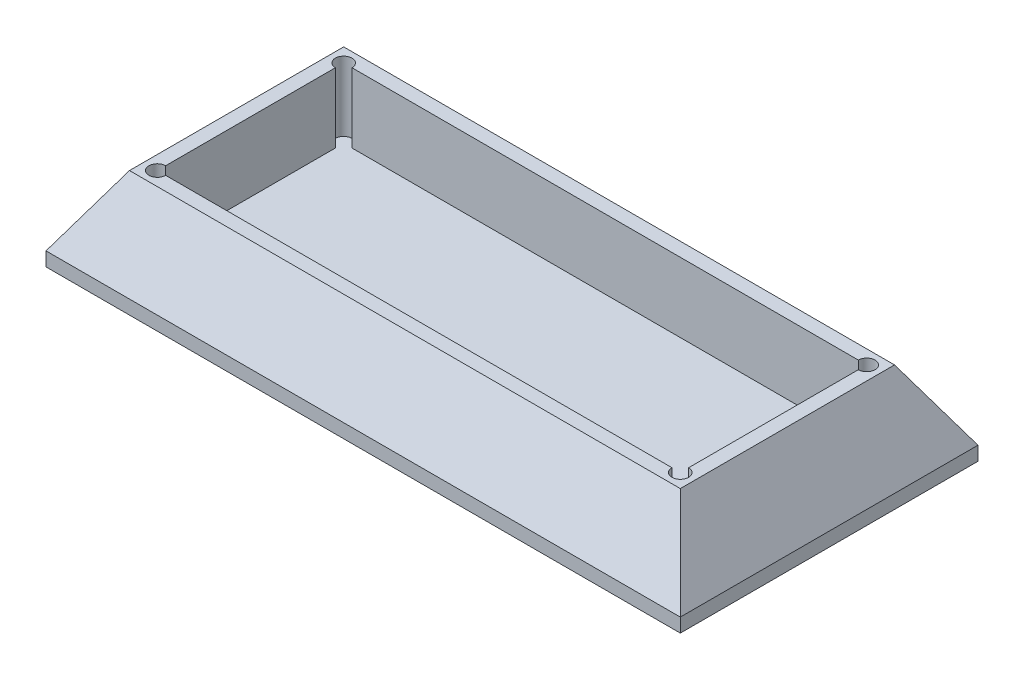
ISO-10303-21;
HEADER;
FILE_DESCRIPTION(('STEP AP214'),'2;1');
FILE_NAME('part.step','',(''),(''),'','','');
FILE_SCHEMA(('AUTOMOTIVE_DESIGN { 1 0 10303 214 1 1 1 1 }'));
ENDSEC;
DATA;
#1=APPLICATION_CONTEXT('core data for automotive mechanical design processes');
#2=APPLICATION_PROTOCOL_DEFINITION('international standard','automotive_design',2000,#1);
#3=PRODUCT_CONTEXT('',#1,'mechanical');
#4=PRODUCT('Part','Part','',(#3));
#5=PRODUCT_RELATED_PRODUCT_CATEGORY('part','',(#4));
#6=PRODUCT_DEFINITION_FORMATION('','',#4);
#7=PRODUCT_DEFINITION_CONTEXT('part definition',#1,'design');
#8=PRODUCT_DEFINITION('design','',#6,#7);
#9=PRODUCT_DEFINITION_SHAPE('','',#8);
#10=(LENGTH_UNIT() NAMED_UNIT(*) SI_UNIT(.MILLI.,.METRE.));
#11=(NAMED_UNIT(*) PLANE_ANGLE_UNIT() SI_UNIT($,.RADIAN.));
#12=(NAMED_UNIT(*) SI_UNIT($,.STERADIAN.) SOLID_ANGLE_UNIT());
#13=UNCERTAINTY_MEASURE_WITH_UNIT(LENGTH_MEASURE(1.E-05),#10,'distance_accuracy_value','');
#14=(GEOMETRIC_REPRESENTATION_CONTEXT(3) GLOBAL_UNCERTAINTY_ASSIGNED_CONTEXT((#13)) GLOBAL_UNIT_ASSIGNED_CONTEXT((#10,
#11,#12)) REPRESENTATION_CONTEXT('',''));
#15=CARTESIAN_POINT('',(0.,0.,0.));
#16=DIRECTION('',(0.,0.,1.));
#17=DIRECTION('',(1.,0.,0.));
#18=AXIS2_PLACEMENT_3D('',#15,#16,#17);
#19=CARTESIAN_POINT('',(-94.,25.,-16.));
#20=DIRECTION('',(1.,0.,0.));
#21=DIRECTION('',(0.,0.,-1.));
#22=AXIS2_PLACEMENT_3D('',#19,#20,#21);
#23=PLANE('',#22);
#24=DIRECTION('',(0.,0.,1.));
#25=VECTOR('',#24,1.);
#26=CARTESIAN_POINT('',(-94.,25.,-16.));
#27=LINE('',#26,#25);
#28=CARTESIAN_POINT('',(-94.,25.,-13.));
#29=VERTEX_POINT('',#28);
#30=CARTESIAN_POINT('',(-94.,25.,48.));
#31=VERTEX_POINT('',#30);
#32=EDGE_CURVE('E209',#29,#31,#27,.T.);
#33=ORIENTED_EDGE('',*,*,#32,.T.);
#34=DIRECTION('',(0.,-1.,0.));
#35=VECTOR('',#34,1.);
#36=CARTESIAN_POINT('',(-94.,750.,48.));
#37=LINE('',#36,#35);
#38=CARTESIAN_POINT('',(-94.,0.,48.));
#39=VERTEX_POINT('',#38);
#40=EDGE_CURVE('E206',#31,#39,#37,.T.);
#41=ORIENTED_EDGE('',*,*,#40,.T.);
#42=DIRECTION('',(0.,0.,1.));
#43=VECTOR('',#42,1.);
#44=CARTESIAN_POINT('',(-94.,0.,-16.));
#45=LINE('',#44,#43);
#46=CARTESIAN_POINT('',(-94.,0.,-13.));
#47=VERTEX_POINT('',#46);
#48=EDGE_CURVE('E208',#47,#39,#45,.T.);
#49=ORIENTED_EDGE('',*,*,#48,.F.);
#50=DIRECTION('',(0.,-1.,0.));
#51=VECTOR('',#50,1.);
#52=CARTESIAN_POINT('',(-94.,750.,-13.));
#53=LINE('',#52,#51);
#54=EDGE_CURVE('E188',#47,#29,#53,.F.);
#55=ORIENTED_EDGE('',*,*,#54,.T.);
#56=EDGE_LOOP('',(#33,#41,#49,#55));
#57=FACE_BOUND('',#56,.T.);
#58=ADVANCED_FACE('F39',(#57),#23,.T.);
#59=CARTESIAN_POINT('',(-94.,25.,51.));
#60=DIRECTION('',(0.,0.,-1.));
#61=DIRECTION('',(-1.,0.,0.));
#62=AXIS2_PLACEMENT_3D('',#59,#60,#61);
#63=PLANE('',#62);
#64=DIRECTION('',(1.,0.,0.));
#65=VECTOR('',#64,1.);
#66=CARTESIAN_POINT('',(-94.,0.,51.));
#67=LINE('',#66,#65);
#68=CARTESIAN_POINT('',(-91.,0.,51.));
#69=VERTEX_POINT('',#68);
#70=CARTESIAN_POINT('',(91.,0.,51.));
#71=VERTEX_POINT('',#70);
#72=EDGE_CURVE('E224',#69,#71,#67,.T.);
#73=ORIENTED_EDGE('',*,*,#72,.F.);
#74=DIRECTION('',(0.,-1.,0.));
#75=VECTOR('',#74,1.);
#76=CARTESIAN_POINT('',(-91.,750.,51.));
#77=LINE('',#76,#75);
#78=CARTESIAN_POINT('',(-91.,25.,51.));
#79=VERTEX_POINT('',#78);
#80=EDGE_CURVE('E244',#69,#79,#77,.F.);
#81=ORIENTED_EDGE('',*,*,#80,.T.);
#82=DIRECTION('',(1.,0.,0.));
#83=VECTOR('',#82,1.);
#84=CARTESIAN_POINT('',(-94.,25.,51.));
#85=LINE('',#84,#83);
#86=CARTESIAN_POINT('',(91.,25.,51.));
#87=VERTEX_POINT('',#86);
#88=EDGE_CURVE('E212',#79,#87,#85,.T.);
#89=ORIENTED_EDGE('',*,*,#88,.T.);
#90=DIRECTION('',(0.,-1.,0.));
#91=VECTOR('',#90,1.);
#92=CARTESIAN_POINT('',(91.,750.,51.));
#93=LINE('',#92,#91);
#94=EDGE_CURVE('E200',#87,#71,#93,.T.);
#95=ORIENTED_EDGE('',*,*,#94,.T.);
#96=EDGE_LOOP('',(#73,#81,#89,#95));
#97=FACE_BOUND('',#96,.T.);
#98=ADVANCED_FACE('F292',(#97),#63,.T.);
#99=CARTESIAN_POINT('',(94.,25.,-16.));
#100=DIRECTION('',(-1.,0.,0.));
#101=DIRECTION('',(0.,0.,1.));
#102=AXIS2_PLACEMENT_3D('',#99,#100,#101);
#103=PLANE('',#102);
#104=DIRECTION('',(0.,0.,-1.));
#105=VECTOR('',#104,1.);
#106=CARTESIAN_POINT('',(94.,0.,-16.));
#107=LINE('',#106,#105);
#108=CARTESIAN_POINT('',(94.,0.,48.));
#109=VERTEX_POINT('',#108);
#110=CARTESIAN_POINT('',(94.,0.,-13.));
#111=VERTEX_POINT('',#110);
#112=EDGE_CURVE('E227',#109,#111,#107,.T.);
#113=ORIENTED_EDGE('',*,*,#112,.F.);
#114=DIRECTION('',(0.,-1.,0.));
#115=VECTOR('',#114,1.);
#116=CARTESIAN_POINT('',(94.,750.,48.));
#117=LINE('',#116,#115);
#118=CARTESIAN_POINT('',(94.,25.,48.));
#119=VERTEX_POINT('',#118);
#120=EDGE_CURVE('E241',#109,#119,#117,.F.);
#121=ORIENTED_EDGE('',*,*,#120,.T.);
#122=DIRECTION('',(0.,0.,-1.));
#123=VECTOR('',#122,1.);
#124=CARTESIAN_POINT('',(94.,25.,-16.));
#125=LINE('',#124,#123);
#126=CARTESIAN_POINT('',(94.,25.,-13.));
#127=VERTEX_POINT('',#126);
#128=EDGE_CURVE('E216',#119,#127,#125,.T.);
#129=ORIENTED_EDGE('',*,*,#128,.T.);
#130=DIRECTION('',(0.,-1.,0.));
#131=VECTOR('',#130,1.);
#132=CARTESIAN_POINT('',(94.,750.,-13.));
#133=LINE('',#132,#131);
#134=EDGE_CURVE('E194',#127,#111,#133,.T.);
#135=ORIENTED_EDGE('',*,*,#134,.T.);
#136=EDGE_LOOP('',(#113,#121,#129,#135));
#137=FACE_BOUND('',#136,.T.);
#138=ADVANCED_FACE('F298',(#137),#103,.T.);
#139=CARTESIAN_POINT('',(-94.,25.,-16.));
#140=DIRECTION('',(0.,0.,1.));
#141=DIRECTION('',(1.,0.,0.));
#142=AXIS2_PLACEMENT_3D('',#139,#140,#141);
#143=PLANE('',#142);
#144=DIRECTION('',(-1.,0.,0.));
#145=VECTOR('',#144,1.);
#146=CARTESIAN_POINT('',(-94.,0.,-16.));
#147=LINE('',#146,#145);
#148=CARTESIAN_POINT('',(91.,0.,-16.));
#149=VERTEX_POINT('',#148);
#150=CARTESIAN_POINT('',(-91.,0.,-16.));
#151=VERTEX_POINT('',#150);
#152=EDGE_CURVE('E213',#149,#151,#147,.T.);
#153=ORIENTED_EDGE('',*,*,#152,.F.);
#154=DIRECTION('',(0.,-1.,0.));
#155=VECTOR('',#154,1.);
#156=CARTESIAN_POINT('',(91.,750.,-16.));
#157=LINE('',#156,#155);
#158=CARTESIAN_POINT('',(91.,25.,-16.));
#159=VERTEX_POINT('',#158);
#160=EDGE_CURVE('E238',#149,#159,#157,.F.);
#161=ORIENTED_EDGE('',*,*,#160,.T.);
#162=DIRECTION('',(-1.,0.,0.));
#163=VECTOR('',#162,1.);
#164=CARTESIAN_POINT('',(-94.,25.,-16.));
#165=LINE('',#164,#163);
#166=CARTESIAN_POINT('',(-91.,25.,-16.));
#167=VERTEX_POINT('',#166);
#168=EDGE_CURVE('E219',#159,#167,#165,.T.);
#169=ORIENTED_EDGE('',*,*,#168,.T.);
#170=DIRECTION('',(0.,-1.,0.));
#171=VECTOR('',#170,1.);
#172=CARTESIAN_POINT('',(-91.,750.,-16.));
#173=LINE('',#172,#171);
#174=EDGE_CURVE('E151',#167,#151,#173,.T.);
#175=ORIENTED_EDGE('',*,*,#174,.T.);
#176=EDGE_LOOP('',(#153,#161,#169,#175));
#177=FACE_BOUND('',#176,.T.);
#178=ADVANCED_FACE('F304',(#177),#143,.T.);
#179=CARTESIAN_POINT('',(0.,25.,0.));
#180=DIRECTION('',(0.,1.,0.));
#181=DIRECTION('',(0.,0.,1.));
#182=AXIS2_PLACEMENT_3D('',#179,#180,#181);
#183=PLANE('',#182);
#184=DIRECTION('',(-1.,0.,0.));
#185=VECTOR('',#184,1.);
#186=CARTESIAN_POINT('',(-114.,25.,-21.));
#187=LINE('',#186,#185);
#188=CARTESIAN_POINT('',(99.,25.,-21.));
#189=VERTEX_POINT('',#188);
#190=CARTESIAN_POINT('',(-98.9999999999999,25.,-21.));
#191=VERTEX_POINT('',#190);
#192=EDGE_CURVE('E251',#189,#191,#187,.T.);
#193=ORIENTED_EDGE('',*,*,#192,.T.);
#194=DIRECTION('',(0.,0.,1.));
#195=VECTOR('',#194,1.);
#196=CARTESIAN_POINT('',(-98.9999999999999,25.,71.));
#197=LINE('',#196,#195);
#198=CARTESIAN_POINT('',(-98.9999999999999,25.,56.));
#199=VERTEX_POINT('',#198);
#200=EDGE_CURVE('E253',#191,#199,#197,.T.);
#201=ORIENTED_EDGE('',*,*,#200,.T.);
#202=DIRECTION('',(1.,0.,0.));
#203=VECTOR('',#202,1.);
#204=CARTESIAN_POINT('',(114.,25.,56.));
#205=LINE('',#204,#203);
#206=CARTESIAN_POINT('',(99.,25.,56.));
#207=VERTEX_POINT('',#206);
#208=EDGE_CURVE('E247',#199,#207,#205,.T.);
#209=ORIENTED_EDGE('',*,*,#208,.T.);
#210=DIRECTION('',(0.,0.,-1.));
#211=VECTOR('',#210,1.);
#212=CARTESIAN_POINT('',(99.,25.,-36.));
#213=LINE('',#212,#211);
#214=EDGE_CURVE('E249',#207,#189,#213,.T.);
#215=ORIENTED_EDGE('',*,*,#214,.T.);
#216=EDGE_LOOP('',(#193,#201,#209,#215));
#217=FACE_BOUND('',#216,.T.);
#218=ORIENTED_EDGE('',*,*,#88,.F.);
#219=CARTESIAN_POINT('',(-94.,25.,51.));
#220=DIRECTION('',(0.,1.,0.));
#221=DIRECTION('',(0.,0.,1.));
#222=AXIS2_PLACEMENT_3D('',#219,#220,#221);
#223=CIRCLE('',#222,3.00000000000001);
#224=EDGE_CURVE('E203',#79,#31,#223,.F.);
#225=ORIENTED_EDGE('',*,*,#224,.T.);
#226=ORIENTED_EDGE('',*,*,#32,.F.);
#227=CARTESIAN_POINT('',(-94.,25.,-16.));
#228=DIRECTION('',(0.,1.,0.));
#229=DIRECTION('',(0.,0.,1.));
#230=AXIS2_PLACEMENT_3D('',#227,#228,#229);
#231=CIRCLE('',#230,3.00000000000001);
#232=EDGE_CURVE('E185',#29,#167,#231,.F.);
#233=ORIENTED_EDGE('',*,*,#232,.T.);
#234=ORIENTED_EDGE('',*,*,#168,.F.);
#235=CARTESIAN_POINT('',(94.,25.,-16.));
#236=DIRECTION('',(0.,1.,0.));
#237=DIRECTION('',(0.,0.,1.));
#238=AXIS2_PLACEMENT_3D('',#235,#236,#237);
#239=CIRCLE('',#238,3.00000000000001);
#240=EDGE_CURVE('E191',#159,#127,#239,.F.);
#241=ORIENTED_EDGE('',*,*,#240,.T.);
#242=ORIENTED_EDGE('',*,*,#128,.F.);
#243=CARTESIAN_POINT('',(94.,25.,51.));
#244=DIRECTION('',(0.,1.,0.));
#245=DIRECTION('',(0.,0.,1.));
#246=AXIS2_PLACEMENT_3D('',#243,#244,#245);
#247=CIRCLE('',#246,3.00000000000001);
#248=EDGE_CURVE('E197',#119,#87,#247,.F.);
#249=ORIENTED_EDGE('',*,*,#248,.T.);
#250=EDGE_LOOP('',(#218,#225,#226,#233,#234,#241,#242,#249));
#251=FACE_BOUND('',#250,.T.);
#252=ADVANCED_FACE('F274',(#217,#251),#183,.T.);
#253=CARTESIAN_POINT('',(-114.,25.,-36.));
#254=DIRECTION('',(1.,0.,0.));
#255=DIRECTION('',(0.,0.,-1.));
#256=AXIS2_PLACEMENT_3D('',#253,#254,#255);
#257=PLANE('',#256);
#258=DIRECTION('',(0.,-1.,0.));
#259=VECTOR('',#258,1.);
#260=CARTESIAN_POINT('',(-114.,25.,71.));
#261=LINE('',#260,#259);
#262=CARTESIAN_POINT('',(-114.,-1.90819582357449E-13,71.));
#263=VERTEX_POINT('',#262);
#264=CARTESIAN_POINT('',(-114.,-5.,71.));
#265=VERTEX_POINT('',#264);
#266=EDGE_CURVE('E142',#263,#265,#261,.T.);
#267=ORIENTED_EDGE('',*,*,#266,.F.);
#268=DIRECTION('',(0.,0.,-1.));
#269=VECTOR('',#268,1.);
#270=CARTESIAN_POINT('',(-114.,-1.90626835304562E-13,-36.));
#271=LINE('',#270,#269);
#272=CARTESIAN_POINT('',(-114.,-1.90819582357449E-13,-36.));
#273=VERTEX_POINT('',#272);
#274=EDGE_CURVE('E256',#263,#273,#271,.T.);
#275=ORIENTED_EDGE('',*,*,#274,.T.);
#276=DIRECTION('',(0.,-1.,0.));
#277=VECTOR('',#276,1.);
#278=CARTESIAN_POINT('',(-114.,25.,-36.));
#279=LINE('',#278,#277);
#280=CARTESIAN_POINT('',(-114.,-5.,-36.));
#281=VERTEX_POINT('',#280);
#282=EDGE_CURVE('E165',#273,#281,#279,.T.);
#283=ORIENTED_EDGE('',*,*,#282,.T.);
#284=DIRECTION('',(0.,0.,1.));
#285=VECTOR('',#284,1.);
#286=CARTESIAN_POINT('',(-114.,-5.,-36.));
#287=LINE('',#286,#285);
#288=EDGE_CURVE('E159',#281,#265,#287,.T.);
#289=ORIENTED_EDGE('',*,*,#288,.T.);
#290=EDGE_LOOP('',(#267,#275,#283,#289));
#291=FACE_BOUND('',#290,.T.);
#292=ADVANCED_FACE('F164',(#291),#257,.F.);
#293=CARTESIAN_POINT('',(-114.,25.,71.));
#294=DIRECTION('',(0.,0.,-1.));
#295=DIRECTION('',(-1.,0.,0.));
#296=AXIS2_PLACEMENT_3D('',#293,#294,#295);
#297=PLANE('',#296);
#298=DIRECTION('',(0.,-1.,0.));
#299=VECTOR('',#298,1.);
#300=CARTESIAN_POINT('',(114.,25.,71.));
#301=LINE('',#300,#299);
#302=CARTESIAN_POINT('',(114.,-1.90819582357449E-13,71.));
#303=VERTEX_POINT('',#302);
#304=CARTESIAN_POINT('',(114.,-5.,71.));
#305=VERTEX_POINT('',#304);
#306=EDGE_CURVE('E152',#303,#305,#301,.T.);
#307=ORIENTED_EDGE('',*,*,#306,.F.);
#308=DIRECTION('',(-1.,0.,0.));
#309=VECTOR('',#308,1.);
#310=CARTESIAN_POINT('',(-114.,-1.9053183882387E-13,71.));
#311=LINE('',#310,#309);
#312=EDGE_CURVE('E11',#303,#263,#311,.T.);
#313=ORIENTED_EDGE('',*,*,#312,.T.);
#314=ORIENTED_EDGE('',*,*,#266,.T.);
#315=DIRECTION('',(1.,0.,0.));
#316=VECTOR('',#315,1.);
#317=CARTESIAN_POINT('',(-114.,-5.,71.));
#318=LINE('',#317,#316);
#319=EDGE_CURVE('E145',#265,#305,#318,.T.);
#320=ORIENTED_EDGE('',*,*,#319,.T.);
#321=EDGE_LOOP('',(#307,#313,#314,#320));
#322=FACE_BOUND('',#321,.T.);
#323=ADVANCED_FACE('F144',(#322),#297,.F.);
#324=CARTESIAN_POINT('',(114.,25.,-36.));
#325=DIRECTION('',(-1.,0.,0.));
#326=DIRECTION('',(0.,0.,1.));
#327=AXIS2_PLACEMENT_3D('',#324,#325,#326);
#328=PLANE('',#327);
#329=DIRECTION('',(0.,-1.,0.));
#330=VECTOR('',#329,1.);
#331=CARTESIAN_POINT('',(114.,25.,-36.));
#332=LINE('',#331,#330);
#333=CARTESIAN_POINT('',(114.,-1.90819582357449E-13,-36.));
#334=VERTEX_POINT('',#333);
#335=CARTESIAN_POINT('',(114.,-5.,-36.));
#336=VERTEX_POINT('',#335);
#337=EDGE_CURVE('E233',#334,#336,#332,.T.);
#338=ORIENTED_EDGE('',*,*,#337,.F.);
#339=DIRECTION('',(0.,0.,1.));
#340=VECTOR('',#339,1.);
#341=CARTESIAN_POINT('',(114.,-1.90721831785255E-13,71.));
#342=LINE('',#341,#340);
#343=EDGE_CURVE('E49',#334,#303,#342,.T.);
#344=ORIENTED_EDGE('',*,*,#343,.T.);
#345=ORIENTED_EDGE('',*,*,#306,.T.);
#346=DIRECTION('',(0.,0.,-1.));
#347=VECTOR('',#346,1.);
#348=CARTESIAN_POINT('',(114.,-5.,-36.));
#349=LINE('',#348,#347);
#350=EDGE_CURVE('E162',#305,#336,#349,.T.);
#351=ORIENTED_EDGE('',*,*,#350,.T.);
#352=EDGE_LOOP('',(#338,#344,#345,#351));
#353=FACE_BOUND('',#352,.T.);
#354=ADVANCED_FACE('F281',(#353),#328,.F.);
#355=CARTESIAN_POINT('',(-114.,25.,-36.));
#356=DIRECTION('',(0.,0.,1.));
#357=DIRECTION('',(1.,0.,0.));
#358=AXIS2_PLACEMENT_3D('',#355,#356,#357);
#359=PLANE('',#358);
#360=ORIENTED_EDGE('',*,*,#282,.F.);
#361=DIRECTION('',(1.,0.,0.));
#362=VECTOR('',#361,1.);
#363=CARTESIAN_POINT('',(114.,-1.90721831785255E-13,-36.));
#364=LINE('',#363,#362);
#365=EDGE_CURVE('E64',#273,#334,#364,.T.);
#366=ORIENTED_EDGE('',*,*,#365,.T.);
#367=ORIENTED_EDGE('',*,*,#337,.T.);
#368=DIRECTION('',(-1.,0.,0.));
#369=VECTOR('',#368,1.);
#370=CARTESIAN_POINT('',(-114.,-5.,-36.));
#371=LINE('',#370,#369);
#372=EDGE_CURVE('E171',#336,#281,#371,.T.);
#373=ORIENTED_EDGE('',*,*,#372,.T.);
#374=EDGE_LOOP('',(#360,#366,#367,#373));
#375=FACE_BOUND('',#374,.T.);
#376=ADVANCED_FACE('F280',(#375),#359,.F.);
#377=CARTESIAN_POINT('',(-94.,750.,-16.));
#378=DIRECTION('',(0.,-1.,0.));
#379=DIRECTION('',(0.,0.,-1.));
#380=AXIS2_PLACEMENT_3D('',#377,#378,#379);
#381=CYLINDRICAL_SURFACE('',#380,3.00000000000001);
#382=CARTESIAN_POINT('',(-94.,0.,-16.));
#383=DIRECTION('',(0.,1.,0.));
#384=DIRECTION('',(0.,0.,1.));
#385=AXIS2_PLACEMENT_3D('',#382,#383,#384);
#386=CIRCLE('',#385,3.00000000000001);
#387=EDGE_CURVE('E177',#151,#47,#386,.T.);
#388=ORIENTED_EDGE('',*,*,#387,.F.);
#389=ORIENTED_EDGE('',*,*,#174,.F.);
#390=ORIENTED_EDGE('',*,*,#232,.F.);
#391=ORIENTED_EDGE('',*,*,#54,.F.);
#392=EDGE_LOOP('',(#388,#389,#390,#391));
#393=FACE_BOUND('',#392,.T.);
#394=ADVANCED_FACE('F288',(#393),#381,.F.);
#395=CARTESIAN_POINT('',(94.,750.,-16.));
#396=DIRECTION('',(0.,-1.,0.));
#397=DIRECTION('',(0.,0.,-1.));
#398=AXIS2_PLACEMENT_3D('',#395,#396,#397);
#399=CYLINDRICAL_SURFACE('',#398,3.00000000000001);
#400=ORIENTED_EDGE('',*,*,#240,.F.);
#401=ORIENTED_EDGE('',*,*,#160,.F.);
#402=CARTESIAN_POINT('',(94.,0.,-16.));
#403=DIRECTION('',(0.,1.,0.));
#404=DIRECTION('',(0.,0.,1.));
#405=AXIS2_PLACEMENT_3D('',#402,#403,#404);
#406=CIRCLE('',#405,3.00000000000001);
#407=EDGE_CURVE('E174',#111,#149,#406,.T.);
#408=ORIENTED_EDGE('',*,*,#407,.F.);
#409=ORIENTED_EDGE('',*,*,#134,.F.);
#410=EDGE_LOOP('',(#400,#401,#408,#409));
#411=FACE_BOUND('',#410,.T.);
#412=ADVANCED_FACE('F320',(#411),#399,.F.);
#413=CARTESIAN_POINT('',(94.,750.,51.));
#414=DIRECTION('',(0.,-1.,0.));
#415=DIRECTION('',(0.,0.,-1.));
#416=AXIS2_PLACEMENT_3D('',#413,#414,#415);
#417=CYLINDRICAL_SURFACE('',#416,3.00000000000001);
#418=ORIENTED_EDGE('',*,*,#248,.F.);
#419=ORIENTED_EDGE('',*,*,#120,.F.);
#420=CARTESIAN_POINT('',(94.,0.,51.));
#421=DIRECTION('',(0.,1.,0.));
#422=DIRECTION('',(0.,0.,1.));
#423=AXIS2_PLACEMENT_3D('',#420,#421,#422);
#424=CIRCLE('',#423,3.00000000000001);
#425=EDGE_CURVE('E178',#71,#109,#424,.T.);
#426=ORIENTED_EDGE('',*,*,#425,.F.);
#427=ORIENTED_EDGE('',*,*,#94,.F.);
#428=EDGE_LOOP('',(#418,#419,#426,#427));
#429=FACE_BOUND('',#428,.T.);
#430=ADVANCED_FACE('F326',(#429),#417,.F.);
#431=CARTESIAN_POINT('',(-94.,750.,51.));
#432=DIRECTION('',(0.,-1.,0.));
#433=DIRECTION('',(0.,0.,-1.));
#434=AXIS2_PLACEMENT_3D('',#431,#432,#433);
#435=CYLINDRICAL_SURFACE('',#434,3.00000000000001);
#436=ORIENTED_EDGE('',*,*,#224,.F.);
#437=ORIENTED_EDGE('',*,*,#80,.F.);
#438=CARTESIAN_POINT('',(-94.,0.,51.));
#439=DIRECTION('',(0.,1.,0.));
#440=DIRECTION('',(0.,0.,1.));
#441=AXIS2_PLACEMENT_3D('',#438,#439,#440);
#442=CIRCLE('',#441,3.00000000000001);
#443=EDGE_CURVE('E173',#39,#69,#442,.T.);
#444=ORIENTED_EDGE('',*,*,#443,.F.);
#445=ORIENTED_EDGE('',*,*,#40,.F.);
#446=EDGE_LOOP('',(#436,#437,#444,#445));
#447=FACE_BOUND('',#446,.T.);
#448=ADVANCED_FACE('F322',(#447),#435,.F.);
#449=CARTESIAN_POINT('',(0.,0.,0.));
#450=DIRECTION('',(0.,1.,0.));
#451=DIRECTION('',(0.,0.,1.));
#452=AXIS2_PLACEMENT_3D('',#449,#450,#451);
#453=PLANE('',#452);
#454=ORIENTED_EDGE('',*,*,#48,.T.);
#455=ORIENTED_EDGE('',*,*,#443,.T.);
#456=ORIENTED_EDGE('',*,*,#72,.T.);
#457=ORIENTED_EDGE('',*,*,#425,.T.);
#458=ORIENTED_EDGE('',*,*,#112,.T.);
#459=ORIENTED_EDGE('',*,*,#407,.T.);
#460=ORIENTED_EDGE('',*,*,#152,.T.);
#461=ORIENTED_EDGE('',*,*,#387,.T.);
#462=EDGE_LOOP('',(#454,#455,#456,#457,#458,#459,#460,#461));
#463=FACE_BOUND('',#462,.T.);
#464=ADVANCED_FACE('F325',(#463),#453,.T.);
#465=CARTESIAN_POINT('',(0.,-5.,0.));
#466=DIRECTION('',(0.,1.,0.));
#467=DIRECTION('',(0.,0.,1.));
#468=AXIS2_PLACEMENT_3D('',#465,#466,#467);
#469=PLANE('',#468);
#470=ORIENTED_EDGE('',*,*,#288,.F.);
#471=ORIENTED_EDGE('',*,*,#372,.F.);
#472=ORIENTED_EDGE('',*,*,#350,.F.);
#473=ORIENTED_EDGE('',*,*,#319,.F.);
#474=EDGE_LOOP('',(#470,#471,#472,#473));
#475=FACE_BOUND('',#474,.T.);
#476=ADVANCED_FACE('F157',(#475),#469,.F.);
#477=CARTESIAN_POINT('',(99.,25.,0.));
#478=DIRECTION('',(0.857492925712545,0.514495755427525,0.));
#479=DIRECTION('',(0.,0.,1.));
#480=AXIS2_PLACEMENT_3D('',#477,#478,#479);
#481=PLANE('',#480);
#482=DIRECTION('',(-0.457495710997813,0.762492851663025,-0.457495710997813));
#483=VECTOR('',#482,1.);
#484=CARTESIAN_POINT('',(78.279069767442,59.5348837209302,35.2790697674419));
#485=LINE('',#484,#483);
#486=EDGE_CURVE('E168',#303,#207,#485,.T.);
#487=ORIENTED_EDGE('',*,*,#486,.F.);
#488=ORIENTED_EDGE('',*,*,#343,.F.);
#489=DIRECTION('',(-0.457495710997813,0.762492851663025,0.457495710997813));
#490=VECTOR('',#489,1.);
#491=CARTESIAN_POINT('',(94.6046511627907,32.3255813953488,-16.6046511627907));
#492=LINE('',#491,#490);
#493=EDGE_CURVE('E44',#189,#334,#492,.F.);
#494=ORIENTED_EDGE('',*,*,#493,.F.);
#495=ORIENTED_EDGE('',*,*,#214,.F.);
#496=EDGE_LOOP('',(#487,#488,#494,#495));
#497=FACE_BOUND('',#496,.T.);
#498=ADVANCED_FACE('F42',(#497),#481,.T.);
#499=CARTESIAN_POINT('',(0.,25.,-21.));
#500=DIRECTION('',(0.,0.514495755427525,-0.857492925712545));
#501=DIRECTION('',(1.,0.,0.));
#502=AXIS2_PLACEMENT_3D('',#499,#500,#501);
#503=PLANE('',#502);
#504=ORIENTED_EDGE('',*,*,#493,.T.);
#505=ORIENTED_EDGE('',*,*,#365,.F.);
#506=DIRECTION('',(0.457495710997813,0.762492851663025,0.457495710997813));
#507=VECTOR('',#506,1.);
#508=CARTESIAN_POINT('',(-78.2790697674419,59.5348837209302,-0.279069767441943));
#509=LINE('',#508,#507);
#510=EDGE_CURVE('E262',#191,#273,#509,.F.);
#511=ORIENTED_EDGE('',*,*,#510,.F.);
#512=ORIENTED_EDGE('',*,*,#192,.F.);
#513=EDGE_LOOP('',(#504,#505,#511,#512));
#514=FACE_BOUND('',#513,.T.);
#515=ADVANCED_FACE('F341',(#514),#503,.T.);
#516=CARTESIAN_POINT('',(0.,25.,56.));
#517=DIRECTION('',(0.,0.514495755427525,0.857492925712545));
#518=DIRECTION('',(-1.,0.,0.));
#519=AXIS2_PLACEMENT_3D('',#516,#517,#518);
#520=PLANE('',#519);
#521=ORIENTED_EDGE('',*,*,#486,.T.);
#522=ORIENTED_EDGE('',*,*,#208,.F.);
#523=DIRECTION('',(-0.457495710997813,-0.762492851663025,0.457495710997813));
#524=VECTOR('',#523,1.);
#525=CARTESIAN_POINT('',(-78.2790697674419,59.5348837209302,35.2790697674419));
#526=LINE('',#525,#524);
#527=EDGE_CURVE('E260',#263,#199,#526,.F.);
#528=ORIENTED_EDGE('',*,*,#527,.F.);
#529=ORIENTED_EDGE('',*,*,#312,.F.);
#530=EDGE_LOOP('',(#521,#522,#528,#529));
#531=FACE_BOUND('',#530,.T.);
#532=ADVANCED_FACE('F267',(#531),#520,.T.);
#533=CARTESIAN_POINT('',(-98.9999999999999,25.,0.));
#534=DIRECTION('',(-0.857492925712545,0.514495755427525,0.));
#535=DIRECTION('',(0.,0.,-1.));
#536=AXIS2_PLACEMENT_3D('',#533,#534,#535);
#537=PLANE('',#536);
#538=ORIENTED_EDGE('',*,*,#510,.T.);
#539=ORIENTED_EDGE('',*,*,#274,.F.);
#540=ORIENTED_EDGE('',*,*,#527,.T.);
#541=ORIENTED_EDGE('',*,*,#200,.F.);
#542=EDGE_LOOP('',(#538,#539,#540,#541));
#543=FACE_BOUND('',#542,.T.);
#544=ADVANCED_FACE('F279',(#543),#537,.T.);
#545=CLOSED_SHELL('',(#58,#98,#138,#178,#252,#292,#323,#354,#376,#394,#412,#430,#448,#464,#476,
#498,#515,#532,#544));
#546=MANIFOLD_SOLID_BREP('B2',#545);
#547=ADVANCED_BREP_SHAPE_REPRESENTATION('',(#18,#546),#14);
#548=SHAPE_DEFINITION_REPRESENTATION(#9,#547);
ENDSEC;
END-ISO-10303-21;
